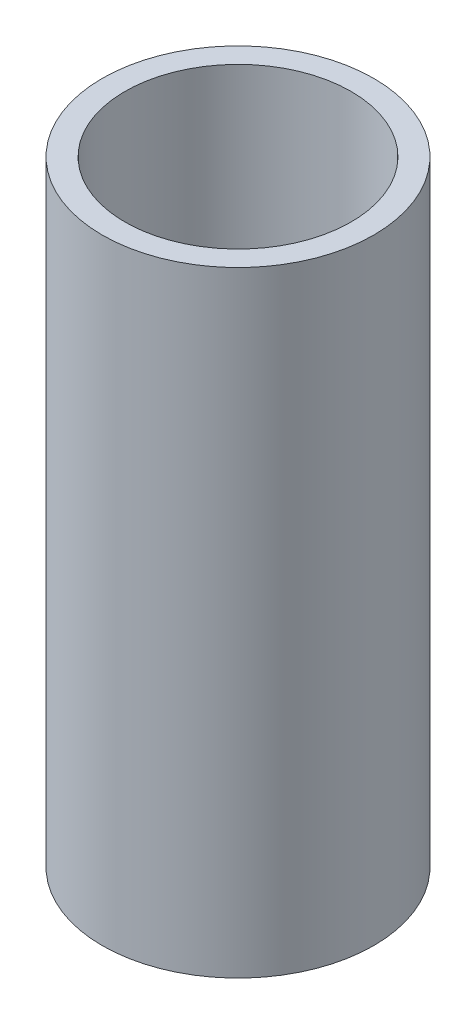
ISO-10303-21;
HEADER;
FILE_DESCRIPTION(('STEP AP214'),'2;1');
FILE_NAME('part.step','',(''),(''),'','','');
FILE_SCHEMA(('AUTOMOTIVE_DESIGN { 1 0 10303 214 1 1 1 1 }'));
ENDSEC;
DATA;
#1=APPLICATION_CONTEXT('core data for automotive mechanical design processes');
#2=APPLICATION_PROTOCOL_DEFINITION('international standard','automotive_design',2000,#1);
#3=PRODUCT_CONTEXT('',#1,'mechanical');
#4=PRODUCT('Part','Part','',(#3));
#5=PRODUCT_RELATED_PRODUCT_CATEGORY('part','',(#4));
#6=PRODUCT_DEFINITION_FORMATION('','',#4);
#7=PRODUCT_DEFINITION_CONTEXT('part definition',#1,'design');
#8=PRODUCT_DEFINITION('design','',#6,#7);
#9=PRODUCT_DEFINITION_SHAPE('','',#8);
#10=(LENGTH_UNIT() NAMED_UNIT(*) SI_UNIT(.MILLI.,.METRE.));
#11=(NAMED_UNIT(*) PLANE_ANGLE_UNIT() SI_UNIT($,.RADIAN.));
#12=(NAMED_UNIT(*) SI_UNIT($,.STERADIAN.) SOLID_ANGLE_UNIT());
#13=UNCERTAINTY_MEASURE_WITH_UNIT(LENGTH_MEASURE(1.E-05),#10,'distance_accuracy_value','');
#14=(GEOMETRIC_REPRESENTATION_CONTEXT(3) GLOBAL_UNCERTAINTY_ASSIGNED_CONTEXT((#13)) GLOBAL_UNIT_ASSIGNED_CONTEXT((#10,
#11,#12)) REPRESENTATION_CONTEXT('',''));
#15=CARTESIAN_POINT('',(0.,0.,0.));
#16=DIRECTION('',(0.,0.,1.));
#17=DIRECTION('',(1.,0.,0.));
#18=AXIS2_PLACEMENT_3D('',#15,#16,#17);
#19=CARTESIAN_POINT('',(0.,0.,0.));
#20=DIRECTION('',(0.,-1.,0.));
#21=DIRECTION('',(0.,0.,-1.));
#22=AXIS2_PLACEMENT_3D('',#19,#20,#21);
#23=CYLINDRICAL_SURFACE('',#22,52.5);
#24=CARTESIAN_POINT('',(0.,0.,0.));
#25=DIRECTION('',(0.,-1.,0.));
#26=DIRECTION('',(0.,0.,-1.));
#27=AXIS2_PLACEMENT_3D('',#24,#25,#26);
#28=CIRCLE('',#27,52.5);
#29=CARTESIAN_POINT('',(0.,0.,-52.5));
#30=VERTEX_POINT('',#29);
#31=EDGE_CURVE('E10',#30,#30,#28,.T.);
#32=ORIENTED_EDGE('',*,*,#31,.F.);
#33=EDGE_LOOP('',(#32));
#34=FACE_BOUND('',#33,.T.);
#35=CARTESIAN_POINT('',(0.,238.,0.));
#36=DIRECTION('',(0.,-1.,0.));
#37=DIRECTION('',(0.,0.,-1.));
#38=AXIS2_PLACEMENT_3D('',#35,#36,#37);
#39=CIRCLE('',#38,52.5);
#40=CARTESIAN_POINT('',(0.,238.,-52.5));
#41=VERTEX_POINT('',#40);
#42=EDGE_CURVE('E54',#41,#41,#39,.T.);
#43=ORIENTED_EDGE('',*,*,#42,.T.);
#44=EDGE_LOOP('',(#43));
#45=FACE_BOUND('',#44,.T.);
#46=ADVANCED_FACE('F37',(#34,#45),#23,.T.);
#47=CARTESIAN_POINT('',(-52.5,0.,0.));
#48=DIRECTION('',(0.,1.,0.));
#49=DIRECTION('',(0.,0.,1.));
#50=AXIS2_PLACEMENT_3D('',#47,#48,#49);
#51=PLANE('',#50);
#52=CARTESIAN_POINT('',(0.,0.,0.));
#53=DIRECTION('',(0.,-1.,0.));
#54=DIRECTION('',(0.,0.,-1.));
#55=AXIS2_PLACEMENT_3D('',#52,#53,#54);
#56=CIRCLE('',#55,43.75);
#57=CARTESIAN_POINT('',(0.,0.,-43.75));
#58=VERTEX_POINT('',#57);
#59=EDGE_CURVE('E44',#58,#58,#56,.T.);
#60=ORIENTED_EDGE('',*,*,#59,.F.);
#61=EDGE_LOOP('',(#60));
#62=FACE_BOUND('',#61,.T.);
#63=ORIENTED_EDGE('',*,*,#31,.T.);
#64=EDGE_LOOP('',(#63));
#65=FACE_BOUND('',#64,.T.);
#66=ADVANCED_FACE('F70',(#62,#65),#51,.F.);
#67=CARTESIAN_POINT('',(0.,0.,0.));
#68=DIRECTION('',(0.,-1.,0.));
#69=DIRECTION('',(0.,0.,-1.));
#70=AXIS2_PLACEMENT_3D('',#67,#68,#69);
#71=CYLINDRICAL_SURFACE('',#70,43.75);
#72=CARTESIAN_POINT('',(0.,238.,0.));
#73=DIRECTION('',(0.,-1.,0.));
#74=DIRECTION('',(0.,0.,-1.));
#75=AXIS2_PLACEMENT_3D('',#72,#73,#74);
#76=CIRCLE('',#75,43.75);
#77=CARTESIAN_POINT('',(0.,238.,-43.75));
#78=VERTEX_POINT('',#77);
#79=EDGE_CURVE('E49',#78,#78,#76,.T.);
#80=ORIENTED_EDGE('',*,*,#79,.F.);
#81=EDGE_LOOP('',(#80));
#82=FACE_BOUND('',#81,.T.);
#83=ORIENTED_EDGE('',*,*,#59,.T.);
#84=EDGE_LOOP('',(#83));
#85=FACE_BOUND('',#84,.T.);
#86=ADVANCED_FACE('F65',(#82,#85),#71,.F.);
#87=CARTESIAN_POINT('',(-43.75,238.,0.));
#88=DIRECTION('',(0.,-1.,0.));
#89=DIRECTION('',(0.,0.,-1.));
#90=AXIS2_PLACEMENT_3D('',#87,#88,#89);
#91=PLANE('',#90);
#92=ORIENTED_EDGE('',*,*,#42,.F.);
#93=EDGE_LOOP('',(#92));
#94=FACE_BOUND('',#93,.T.);
#95=ORIENTED_EDGE('',*,*,#79,.T.);
#96=EDGE_LOOP('',(#95));
#97=FACE_BOUND('',#96,.T.);
#98=ADVANCED_FACE('F62',(#94,#97),#91,.F.);
#99=CLOSED_SHELL('',(#46,#66,#86,#98));
#100=MANIFOLD_SOLID_BREP('B2',#99);
#101=ADVANCED_BREP_SHAPE_REPRESENTATION('',(#18,#100),#14);
#102=SHAPE_DEFINITION_REPRESENTATION(#9,#101);
ENDSEC;
END-ISO-10303-21;
